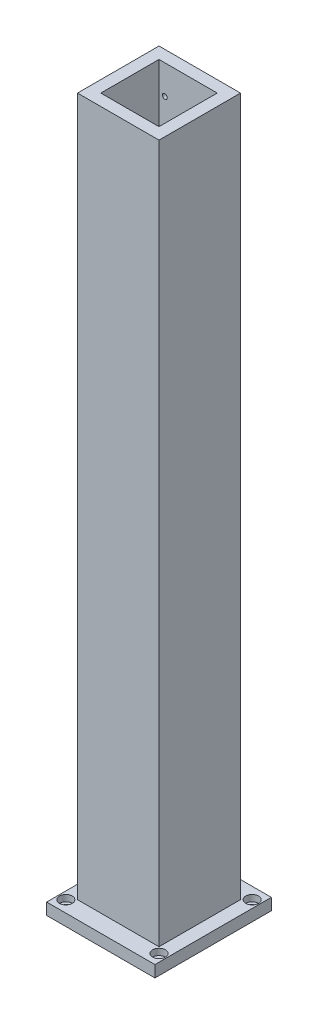
ISO-10303-21;
HEADER;
FILE_DESCRIPTION(('STEP AP214'),'2;1');
FILE_NAME('part.step','',(''),(''),'','','');
FILE_SCHEMA(('AUTOMOTIVE_DESIGN { 1 0 10303 214 1 1 1 1 }'));
ENDSEC;
DATA;
#1=APPLICATION_CONTEXT('core data for automotive mechanical design processes');
#2=APPLICATION_PROTOCOL_DEFINITION('international standard','automotive_design',2000,#1);
#3=PRODUCT_CONTEXT('',#1,'mechanical');
#4=PRODUCT('Part','Part','',(#3));
#5=PRODUCT_RELATED_PRODUCT_CATEGORY('part','',(#4));
#6=PRODUCT_DEFINITION_FORMATION('','',#4);
#7=PRODUCT_DEFINITION_CONTEXT('part definition',#1,'design');
#8=PRODUCT_DEFINITION('design','',#6,#7);
#9=PRODUCT_DEFINITION_SHAPE('','',#8);
#10=(LENGTH_UNIT() NAMED_UNIT(*) SI_UNIT(.MILLI.,.METRE.));
#11=(NAMED_UNIT(*) PLANE_ANGLE_UNIT() SI_UNIT($,.RADIAN.));
#12=(NAMED_UNIT(*) SI_UNIT($,.STERADIAN.) SOLID_ANGLE_UNIT());
#13=UNCERTAINTY_MEASURE_WITH_UNIT(LENGTH_MEASURE(1.E-05),#10,'distance_accuracy_value','');
#14=(GEOMETRIC_REPRESENTATION_CONTEXT(3) GLOBAL_UNCERTAINTY_ASSIGNED_CONTEXT((#13)) GLOBAL_UNIT_ASSIGNED_CONTEXT((#10,
#11,#12)) REPRESENTATION_CONTEXT('',''));
#15=CARTESIAN_POINT('',(0.,0.,0.));
#16=DIRECTION('',(0.,0.,1.));
#17=DIRECTION('',(1.,0.,0.));
#18=AXIS2_PLACEMENT_3D('',#15,#16,#17);
#19=CARTESIAN_POINT('',(-40.,0.,-40.));
#20=DIRECTION('',(0.,1.,0.));
#21=DIRECTION('',(0.,0.,1.));
#22=AXIS2_PLACEMENT_3D('',#19,#20,#21);
#23=CYLINDRICAL_SURFACE('',#22,2.75);
#24=CARTESIAN_POINT('',(-40.,0.,-40.));
#25=DIRECTION('',(0.,1.,0.));
#26=DIRECTION('',(0.,0.,1.));
#27=AXIS2_PLACEMENT_3D('',#24,#25,#26);
#28=CIRCLE('',#27,2.75);
#29=CARTESIAN_POINT('',(-40.,0.,-37.25));
#30=VERTEX_POINT('',#29);
#31=EDGE_CURVE('E310',#30,#30,#28,.T.);
#32=ORIENTED_EDGE('',*,*,#31,.F.);
#33=EDGE_LOOP('',(#32));
#34=FACE_BOUND('',#33,.T.);
#35=CARTESIAN_POINT('',(-40.,4.5,-40.));
#36=DIRECTION('',(0.,1.,0.));
#37=DIRECTION('',(0.,0.,1.));
#38=AXIS2_PLACEMENT_3D('',#35,#36,#37);
#39=CIRCLE('',#38,2.75);
#40=CARTESIAN_POINT('',(-40.,4.5,-37.25));
#41=VERTEX_POINT('',#40);
#42=EDGE_CURVE('E46',#41,#41,#39,.F.);
#43=ORIENTED_EDGE('',*,*,#42,.F.);
#44=EDGE_LOOP('',(#43));
#45=FACE_BOUND('',#44,.T.);
#46=ADVANCED_FACE('F42',(#34,#45),#23,.F.);
#47=CARTESIAN_POINT('',(-40.,0.,40.));
#48=DIRECTION('',(0.,1.,0.));
#49=DIRECTION('',(0.,0.,1.));
#50=AXIS2_PLACEMENT_3D('',#47,#48,#49);
#51=CYLINDRICAL_SURFACE('',#50,2.75);
#52=CARTESIAN_POINT('',(-40.,0.,40.));
#53=DIRECTION('',(0.,1.,0.));
#54=DIRECTION('',(0.,0.,1.));
#55=AXIS2_PLACEMENT_3D('',#52,#53,#54);
#56=CIRCLE('',#55,2.75);
#57=CARTESIAN_POINT('',(-40.,0.,42.75));
#58=VERTEX_POINT('',#57);
#59=EDGE_CURVE('E306',#58,#58,#56,.T.);
#60=ORIENTED_EDGE('',*,*,#59,.F.);
#61=EDGE_LOOP('',(#60));
#62=FACE_BOUND('',#61,.T.);
#63=CARTESIAN_POINT('',(-40.,4.5,40.));
#64=DIRECTION('',(0.,1.,0.));
#65=DIRECTION('',(0.,0.,1.));
#66=AXIS2_PLACEMENT_3D('',#63,#64,#65);
#67=CIRCLE('',#66,2.75);
#68=CARTESIAN_POINT('',(-40.,4.5,42.75));
#69=VERTEX_POINT('',#68);
#70=EDGE_CURVE('E285',#69,#69,#67,.F.);
#71=ORIENTED_EDGE('',*,*,#70,.F.);
#72=EDGE_LOOP('',(#71));
#73=FACE_BOUND('',#72,.T.);
#74=ADVANCED_FACE('F354',(#62,#73),#51,.F.);
#75=CARTESIAN_POINT('',(40.,0.,40.));
#76=DIRECTION('',(0.,1.,0.));
#77=DIRECTION('',(0.,0.,1.));
#78=AXIS2_PLACEMENT_3D('',#75,#76,#77);
#79=CYLINDRICAL_SURFACE('',#78,2.75);
#80=CARTESIAN_POINT('',(40.,0.,40.));
#81=DIRECTION('',(0.,1.,0.));
#82=DIRECTION('',(0.,0.,1.));
#83=AXIS2_PLACEMENT_3D('',#80,#81,#82);
#84=CIRCLE('',#83,2.75);
#85=CARTESIAN_POINT('',(40.,0.,42.75));
#86=VERTEX_POINT('',#85);
#87=EDGE_CURVE('E299',#86,#86,#84,.T.);
#88=ORIENTED_EDGE('',*,*,#87,.F.);
#89=EDGE_LOOP('',(#88));
#90=FACE_BOUND('',#89,.T.);
#91=CARTESIAN_POINT('',(40.,4.5,40.));
#92=DIRECTION('',(0.,1.,0.));
#93=DIRECTION('',(0.,0.,1.));
#94=AXIS2_PLACEMENT_3D('',#91,#92,#93);
#95=CIRCLE('',#94,2.75);
#96=CARTESIAN_POINT('',(40.,4.5,42.75));
#97=VERTEX_POINT('',#96);
#98=EDGE_CURVE('E281',#97,#97,#95,.F.);
#99=ORIENTED_EDGE('',*,*,#98,.F.);
#100=EDGE_LOOP('',(#99));
#101=FACE_BOUND('',#100,.T.);
#102=ADVANCED_FACE('F360',(#90,#101),#79,.F.);
#103=CARTESIAN_POINT('',(40.,0.,-40.));
#104=DIRECTION('',(0.,1.,0.));
#105=DIRECTION('',(0.,0.,1.));
#106=AXIS2_PLACEMENT_3D('',#103,#104,#105);
#107=CYLINDRICAL_SURFACE('',#106,2.75);
#108=CARTESIAN_POINT('',(40.,0.,-40.));
#109=DIRECTION('',(0.,1.,0.));
#110=DIRECTION('',(0.,0.,1.));
#111=AXIS2_PLACEMENT_3D('',#108,#109,#110);
#112=CIRCLE('',#111,2.75);
#113=CARTESIAN_POINT('',(40.,0.,-37.25));
#114=VERTEX_POINT('',#113);
#115=EDGE_CURVE('E293',#114,#114,#112,.T.);
#116=ORIENTED_EDGE('',*,*,#115,.F.);
#117=EDGE_LOOP('',(#116));
#118=FACE_BOUND('',#117,.T.);
#119=CARTESIAN_POINT('',(40.,4.5,-40.));
#120=DIRECTION('',(0.,1.,0.));
#121=DIRECTION('',(0.,0.,1.));
#122=AXIS2_PLACEMENT_3D('',#119,#120,#121);
#123=CIRCLE('',#122,2.75);
#124=CARTESIAN_POINT('',(40.,4.5,-37.25));
#125=VERTEX_POINT('',#124);
#126=EDGE_CURVE('E277',#125,#125,#123,.F.);
#127=ORIENTED_EDGE('',*,*,#126,.F.);
#128=EDGE_LOOP('',(#127));
#129=FACE_BOUND('',#128,.T.);
#130=ADVANCED_FACE('F367',(#118,#129),#107,.F.);
#131=CARTESIAN_POINT('',(0.,10.,0.));
#132=DIRECTION('',(0.,-1.,0.));
#133=DIRECTION('',(0.,0.,-1.));
#134=AXIS2_PLACEMENT_3D('',#131,#132,#133);
#135=PLANE('',#134);
#136=CARTESIAN_POINT('',(-40.,10.,40.));
#137=DIRECTION('',(0.,1.,0.));
#138=DIRECTION('',(0.,0.,1.));
#139=AXIS2_PLACEMENT_3D('',#136,#137,#138);
#140=CIRCLE('',#139,5.5);
#141=CARTESIAN_POINT('',(-40.,10.,45.5));
#142=VERTEX_POINT('',#141);
#143=EDGE_CURVE('E411',#142,#142,#140,.T.);
#144=ORIENTED_EDGE('',*,*,#143,.F.);
#145=EDGE_LOOP('',(#144));
#146=FACE_BOUND('',#145,.T.);
#147=CARTESIAN_POINT('',(40.,10.,40.));
#148=DIRECTION('',(0.,1.,0.));
#149=DIRECTION('',(0.,0.,1.));
#150=AXIS2_PLACEMENT_3D('',#147,#148,#149);
#151=CIRCLE('',#150,5.5);
#152=CARTESIAN_POINT('',(40.,10.,45.5));
#153=VERTEX_POINT('',#152);
#154=EDGE_CURVE('E415',#153,#153,#151,.T.);
#155=ORIENTED_EDGE('',*,*,#154,.F.);
#156=EDGE_LOOP('',(#155));
#157=FACE_BOUND('',#156,.T.);
#158=CARTESIAN_POINT('',(40.,10.,-40.));
#159=DIRECTION('',(0.,1.,0.));
#160=DIRECTION('',(0.,0.,1.));
#161=AXIS2_PLACEMENT_3D('',#158,#159,#160);
#162=CIRCLE('',#161,5.5);
#163=CARTESIAN_POINT('',(40.,10.,-34.5));
#164=VERTEX_POINT('',#163);
#165=EDGE_CURVE('E419',#164,#164,#162,.T.);
#166=ORIENTED_EDGE('',*,*,#165,.F.);
#167=EDGE_LOOP('',(#166));
#168=FACE_BOUND('',#167,.T.);
#169=CARTESIAN_POINT('',(-40.,10.,-40.));
#170=DIRECTION('',(0.,1.,0.));
#171=DIRECTION('',(0.,0.,1.));
#172=AXIS2_PLACEMENT_3D('',#169,#170,#171);
#173=CIRCLE('',#172,5.5);
#174=CARTESIAN_POINT('',(-40.,10.,-34.5));
#175=VERTEX_POINT('',#174);
#176=EDGE_CURVE('E423',#175,#175,#173,.T.);
#177=ORIENTED_EDGE('',*,*,#176,.F.);
#178=EDGE_LOOP('',(#177));
#179=FACE_BOUND('',#178,.T.);
#180=DIRECTION('',(0.,0.,-1.));
#181=VECTOR('',#180,1.);
#182=CARTESIAN_POINT('',(46.5,10.,50.));
#183=LINE('',#182,#181);
#184=CARTESIAN_POINT('',(46.5,10.,50.));
#185=VERTEX_POINT('',#184);
#186=CARTESIAN_POINT('',(46.5,10.,-50.));
#187=VERTEX_POINT('',#186);
#188=EDGE_CURVE('E230',#185,#187,#183,.T.);
#189=ORIENTED_EDGE('',*,*,#188,.T.);
#190=DIRECTION('',(-1.,0.,0.));
#191=VECTOR('',#190,1.);
#192=CARTESIAN_POINT('',(-46.5,10.,-50.));
#193=LINE('',#192,#191);
#194=CARTESIAN_POINT('',(-46.5,10.,-50.));
#195=VERTEX_POINT('',#194);
#196=EDGE_CURVE('E234',#187,#195,#193,.T.);
#197=ORIENTED_EDGE('',*,*,#196,.T.);
#198=DIRECTION('',(0.,0.,1.));
#199=VECTOR('',#198,1.);
#200=CARTESIAN_POINT('',(-46.5,10.,50.));
#201=LINE('',#200,#199);
#202=CARTESIAN_POINT('',(-46.5,10.,50.));
#203=VERTEX_POINT('',#202);
#204=EDGE_CURVE('E238',#195,#203,#201,.T.);
#205=ORIENTED_EDGE('',*,*,#204,.T.);
#206=DIRECTION('',(1.,0.,0.));
#207=VECTOR('',#206,1.);
#208=CARTESIAN_POINT('',(-46.5,10.,50.));
#209=LINE('',#208,#207);
#210=EDGE_CURVE('E241',#203,#185,#209,.T.);
#211=ORIENTED_EDGE('',*,*,#210,.T.);
#212=EDGE_LOOP('',(#189,#197,#205,#211));
#213=FACE_BOUND('',#212,.T.);
#214=DIRECTION('',(0.,0.,1.));
#215=VECTOR('',#214,1.);
#216=CARTESIAN_POINT('',(-35.,10.,35.));
#217=LINE('',#216,#215);
#218=CARTESIAN_POINT('',(-35.,10.,-35.));
#219=VERTEX_POINT('',#218);
#220=CARTESIAN_POINT('',(-35.,10.,35.));
#221=VERTEX_POINT('',#220);
#222=EDGE_CURVE('E153',#219,#221,#217,.T.);
#223=ORIENTED_EDGE('',*,*,#222,.F.);
#224=DIRECTION('',(-1.,0.,0.));
#225=VECTOR('',#224,1.);
#226=CARTESIAN_POINT('',(-35.,10.,-35.));
#227=LINE('',#226,#225);
#228=CARTESIAN_POINT('',(35.,10.,-35.));
#229=VERTEX_POINT('',#228);
#230=EDGE_CURVE('E195',#229,#219,#227,.T.);
#231=ORIENTED_EDGE('',*,*,#230,.F.);
#232=DIRECTION('',(0.,0.,-1.));
#233=VECTOR('',#232,1.);
#234=CARTESIAN_POINT('',(35.,10.,35.));
#235=LINE('',#234,#233);
#236=CARTESIAN_POINT('',(35.,10.,35.));
#237=VERTEX_POINT('',#236);
#238=EDGE_CURVE('E65',#237,#229,#235,.T.);
#239=ORIENTED_EDGE('',*,*,#238,.F.);
#240=DIRECTION('',(1.,0.,0.));
#241=VECTOR('',#240,1.);
#242=CARTESIAN_POINT('',(-35.,10.,35.));
#243=LINE('',#242,#241);
#244=EDGE_CURVE('E60',#221,#237,#243,.T.);
#245=ORIENTED_EDGE('',*,*,#244,.F.);
#246=EDGE_LOOP('',(#223,#231,#239,#245));
#247=FACE_BOUND('',#246,.T.);
#248=ADVANCED_FACE('F392',(#146,#157,#168,#179,#213,#247),#135,.F.);
#249=CARTESIAN_POINT('',(46.5,10.,50.));
#250=DIRECTION('',(-1.,0.,0.));
#251=DIRECTION('',(0.,0.,1.));
#252=AXIS2_PLACEMENT_3D('',#249,#250,#251);
#253=PLANE('',#252);
#254=DIRECTION('',(0.,0.,-1.));
#255=VECTOR('',#254,1.);
#256=CARTESIAN_POINT('',(46.5,0.,50.));
#257=LINE('',#256,#255);
#258=CARTESIAN_POINT('',(46.5,0.,50.));
#259=VERTEX_POINT('',#258);
#260=CARTESIAN_POINT('',(46.5,0.,-50.));
#261=VERTEX_POINT('',#260);
#262=EDGE_CURVE('E229',#259,#261,#257,.T.);
#263=ORIENTED_EDGE('',*,*,#262,.T.);
#264=DIRECTION('',(0.,-1.,0.));
#265=VECTOR('',#264,1.);
#266=CARTESIAN_POINT('',(46.5,10.,-50.));
#267=LINE('',#266,#265);
#268=EDGE_CURVE('E11',#187,#261,#267,.T.);
#269=ORIENTED_EDGE('',*,*,#268,.F.);
#270=ORIENTED_EDGE('',*,*,#188,.F.);
#271=DIRECTION('',(0.,-1.,0.));
#272=VECTOR('',#271,1.);
#273=CARTESIAN_POINT('',(46.5,10.,50.));
#274=LINE('',#273,#272);
#275=EDGE_CURVE('E244',#185,#259,#274,.T.);
#276=ORIENTED_EDGE('',*,*,#275,.T.);
#277=EDGE_LOOP('',(#263,#269,#270,#276));
#278=FACE_BOUND('',#277,.T.);
#279=ADVANCED_FACE('F44',(#278),#253,.F.);
#280=CARTESIAN_POINT('',(-46.5,10.,-50.));
#281=DIRECTION('',(0.,0.,1.));
#282=DIRECTION('',(1.,0.,0.));
#283=AXIS2_PLACEMENT_3D('',#280,#281,#282);
#284=PLANE('',#283);
#285=DIRECTION('',(-1.,0.,0.));
#286=VECTOR('',#285,1.);
#287=CARTESIAN_POINT('',(-46.5,0.,-50.));
#288=LINE('',#287,#286);
#289=CARTESIAN_POINT('',(-46.5,0.,-50.));
#290=VERTEX_POINT('',#289);
#291=EDGE_CURVE('E248',#261,#290,#288,.T.);
#292=ORIENTED_EDGE('',*,*,#291,.T.);
#293=DIRECTION('',(0.,-1.,0.));
#294=VECTOR('',#293,1.);
#295=CARTESIAN_POINT('',(-46.5,10.,-50.));
#296=LINE('',#295,#294);
#297=EDGE_CURVE('E52',#195,#290,#296,.T.);
#298=ORIENTED_EDGE('',*,*,#297,.F.);
#299=ORIENTED_EDGE('',*,*,#196,.F.);
#300=ORIENTED_EDGE('',*,*,#268,.T.);
#301=EDGE_LOOP('',(#292,#298,#299,#300));
#302=FACE_BOUND('',#301,.T.);
#303=ADVANCED_FACE('F405',(#302),#284,.F.);
#304=CARTESIAN_POINT('',(-46.5,10.,50.));
#305=DIRECTION('',(1.,0.,0.));
#306=DIRECTION('',(0.,0.,-1.));
#307=AXIS2_PLACEMENT_3D('',#304,#305,#306);
#308=PLANE('',#307);
#309=DIRECTION('',(0.,0.,1.));
#310=VECTOR('',#309,1.);
#311=CARTESIAN_POINT('',(-46.5,0.,50.));
#312=LINE('',#311,#310);
#313=CARTESIAN_POINT('',(-46.5,0.,50.));
#314=VERTEX_POINT('',#313);
#315=EDGE_CURVE('E251',#290,#314,#312,.T.);
#316=ORIENTED_EDGE('',*,*,#315,.T.);
#317=DIRECTION('',(0.,-1.,0.));
#318=VECTOR('',#317,1.);
#319=CARTESIAN_POINT('',(-46.5,10.,50.));
#320=LINE('',#319,#318);
#321=EDGE_CURVE('E259',#203,#314,#320,.T.);
#322=ORIENTED_EDGE('',*,*,#321,.F.);
#323=ORIENTED_EDGE('',*,*,#204,.F.);
#324=ORIENTED_EDGE('',*,*,#297,.T.);
#325=EDGE_LOOP('',(#316,#322,#323,#324));
#326=FACE_BOUND('',#325,.T.);
#327=ADVANCED_FACE('F461',(#326),#308,.F.);
#328=CARTESIAN_POINT('',(-46.5,10.,50.));
#329=DIRECTION('',(0.,0.,-1.));
#330=DIRECTION('',(-1.,0.,0.));
#331=AXIS2_PLACEMENT_3D('',#328,#329,#330);
#332=PLANE('',#331);
#333=DIRECTION('',(1.,0.,0.));
#334=VECTOR('',#333,1.);
#335=CARTESIAN_POINT('',(-46.5,0.,50.));
#336=LINE('',#335,#334);
#337=EDGE_CURVE('E235',#314,#259,#336,.T.);
#338=ORIENTED_EDGE('',*,*,#337,.T.);
#339=ORIENTED_EDGE('',*,*,#275,.F.);
#340=ORIENTED_EDGE('',*,*,#210,.F.);
#341=ORIENTED_EDGE('',*,*,#321,.T.);
#342=EDGE_LOOP('',(#338,#339,#340,#341));
#343=FACE_BOUND('',#342,.T.);
#344=ADVANCED_FACE('F457',(#343),#332,.F.);
#345=CARTESIAN_POINT('',(0.,0.,0.));
#346=DIRECTION('',(0.,-1.,0.));
#347=DIRECTION('',(0.,0.,-1.));
#348=AXIS2_PLACEMENT_3D('',#345,#346,#347);
#349=PLANE('',#348);
#350=ORIENTED_EDGE('',*,*,#115,.T.);
#351=EDGE_LOOP('',(#350));
#352=FACE_BOUND('',#351,.T.);
#353=ORIENTED_EDGE('',*,*,#87,.T.);
#354=EDGE_LOOP('',(#353));
#355=FACE_BOUND('',#354,.T.);
#356=ORIENTED_EDGE('',*,*,#59,.T.);
#357=EDGE_LOOP('',(#356));
#358=FACE_BOUND('',#357,.T.);
#359=ORIENTED_EDGE('',*,*,#31,.T.);
#360=EDGE_LOOP('',(#359));
#361=FACE_BOUND('',#360,.T.);
#362=ORIENTED_EDGE('',*,*,#262,.F.);
#363=ORIENTED_EDGE('',*,*,#337,.F.);
#364=ORIENTED_EDGE('',*,*,#315,.F.);
#365=ORIENTED_EDGE('',*,*,#291,.F.);
#366=EDGE_LOOP('',(#362,#363,#364,#365));
#367=FACE_BOUND('',#366,.T.);
#368=ADVANCED_FACE('F453',(#352,#355,#358,#361,#367),#349,.T.);
#369=CARTESIAN_POINT('',(0.,610.,0.));
#370=DIRECTION('',(0.,-1.,0.));
#371=DIRECTION('',(0.,0.,-1.));
#372=AXIS2_PLACEMENT_3D('',#369,#370,#371);
#373=PLANE('',#372);
#374=DIRECTION('',(0.,0.,1.));
#375=VECTOR('',#374,1.);
#376=CARTESIAN_POINT('',(-35.,610.,35.));
#377=LINE('',#376,#375);
#378=CARTESIAN_POINT('',(-35.,610.,-35.));
#379=VERTEX_POINT('',#378);
#380=CARTESIAN_POINT('',(-35.,610.,35.));
#381=VERTEX_POINT('',#380);
#382=EDGE_CURVE('E190',#379,#381,#377,.T.);
#383=ORIENTED_EDGE('',*,*,#382,.T.);
#384=DIRECTION('',(1.,0.,0.));
#385=VECTOR('',#384,1.);
#386=CARTESIAN_POINT('',(-35.,610.,35.));
#387=LINE('',#386,#385);
#388=CARTESIAN_POINT('',(35.,610.,35.));
#389=VERTEX_POINT('',#388);
#390=EDGE_CURVE('E194',#381,#389,#387,.T.);
#391=ORIENTED_EDGE('',*,*,#390,.T.);
#392=DIRECTION('',(0.,0.,-1.));
#393=VECTOR('',#392,1.);
#394=CARTESIAN_POINT('',(35.,610.,35.));
#395=LINE('',#394,#393);
#396=CARTESIAN_POINT('',(35.,610.,-35.));
#397=VERTEX_POINT('',#396);
#398=EDGE_CURVE('E198',#389,#397,#395,.T.);
#399=ORIENTED_EDGE('',*,*,#398,.T.);
#400=DIRECTION('',(-1.,0.,0.));
#401=VECTOR('',#400,1.);
#402=CARTESIAN_POINT('',(-35.,610.,-35.));
#403=LINE('',#402,#401);
#404=EDGE_CURVE('E201',#397,#379,#403,.T.);
#405=ORIENTED_EDGE('',*,*,#404,.T.);
#406=EDGE_LOOP('',(#383,#391,#399,#405));
#407=FACE_BOUND('',#406,.T.);
#408=DIRECTION('',(0.,0.,-1.));
#409=VECTOR('',#408,1.);
#410=CARTESIAN_POINT('',(25.,610.,25.));
#411=LINE('',#410,#409);
#412=CARTESIAN_POINT('',(25.,610.,25.));
#413=VERTEX_POINT('',#412);
#414=CARTESIAN_POINT('',(25.,610.,-25.));
#415=VERTEX_POINT('',#414);
#416=EDGE_CURVE('E133',#413,#415,#411,.T.);
#417=ORIENTED_EDGE('',*,*,#416,.F.);
#418=DIRECTION('',(1.,0.,0.));
#419=VECTOR('',#418,1.);
#420=CARTESIAN_POINT('',(-25.,610.,25.));
#421=LINE('',#420,#419);
#422=CARTESIAN_POINT('',(-25.,610.,25.));
#423=VERTEX_POINT('',#422);
#424=EDGE_CURVE('E164',#423,#413,#421,.T.);
#425=ORIENTED_EDGE('',*,*,#424,.F.);
#426=DIRECTION('',(0.,0.,1.));
#427=VECTOR('',#426,1.);
#428=CARTESIAN_POINT('',(-25.,610.,25.));
#429=LINE('',#428,#427);
#430=CARTESIAN_POINT('',(-25.,610.,-25.));
#431=VERTEX_POINT('',#430);
#432=EDGE_CURVE('E159',#431,#423,#429,.T.);
#433=ORIENTED_EDGE('',*,*,#432,.F.);
#434=DIRECTION('',(-1.,0.,0.));
#435=VECTOR('',#434,1.);
#436=CARTESIAN_POINT('',(-25.,610.,-25.));
#437=LINE('',#436,#435);
#438=EDGE_CURVE('E144',#415,#431,#437,.T.);
#439=ORIENTED_EDGE('',*,*,#438,.F.);
#440=EDGE_LOOP('',(#417,#425,#433,#439));
#441=FACE_BOUND('',#440,.T.);
#442=ADVANCED_FACE('F157',(#407,#441),#373,.F.);
#443=CARTESIAN_POINT('',(-35.,610.,35.));
#444=DIRECTION('',(1.,0.,0.));
#445=DIRECTION('',(0.,0.,-1.));
#446=AXIS2_PLACEMENT_3D('',#443,#444,#445);
#447=PLANE('',#446);
#448=ORIENTED_EDGE('',*,*,#222,.T.);
#449=DIRECTION('',(0.,-1.,0.));
#450=VECTOR('',#449,1.);
#451=CARTESIAN_POINT('',(-35.,610.,35.));
#452=LINE('',#451,#450);
#453=EDGE_CURVE('E226',#381,#221,#452,.T.);
#454=ORIENTED_EDGE('',*,*,#453,.F.);
#455=ORIENTED_EDGE('',*,*,#382,.F.);
#456=DIRECTION('',(0.,-1.,0.));
#457=VECTOR('',#456,1.);
#458=CARTESIAN_POINT('',(-35.,610.,-35.));
#459=LINE('',#458,#457);
#460=EDGE_CURVE('E204',#379,#219,#459,.T.);
#461=ORIENTED_EDGE('',*,*,#460,.T.);
#462=EDGE_LOOP('',(#448,#454,#455,#461));
#463=FACE_BOUND('',#462,.T.);
#464=ADVANCED_FACE('F433',(#463),#447,.F.);
#465=CARTESIAN_POINT('',(-35.,610.,35.));
#466=DIRECTION('',(0.,0.,-1.));
#467=DIRECTION('',(-1.,0.,0.));
#468=AXIS2_PLACEMENT_3D('',#465,#466,#467);
#469=PLANE('',#468);
#470=ORIENTED_EDGE('',*,*,#244,.T.);
#471=DIRECTION('',(0.,-1.,0.));
#472=VECTOR('',#471,1.);
#473=CARTESIAN_POINT('',(35.,610.,35.));
#474=LINE('',#473,#472);
#475=EDGE_CURVE('E222',#389,#237,#474,.T.);
#476=ORIENTED_EDGE('',*,*,#475,.F.);
#477=ORIENTED_EDGE('',*,*,#390,.F.);
#478=ORIENTED_EDGE('',*,*,#453,.T.);
#479=EDGE_LOOP('',(#470,#476,#477,#478));
#480=FACE_BOUND('',#479,.T.);
#481=ADVANCED_FACE('F440',(#480),#469,.F.);
#482=CARTESIAN_POINT('',(35.,610.,35.));
#483=DIRECTION('',(-1.,0.,0.));
#484=DIRECTION('',(0.,0.,1.));
#485=AXIS2_PLACEMENT_3D('',#482,#483,#484);
#486=PLANE('',#485);
#487=ORIENTED_EDGE('',*,*,#238,.T.);
#488=DIRECTION('',(0.,-1.,0.));
#489=VECTOR('',#488,1.);
#490=CARTESIAN_POINT('',(35.,610.,-35.));
#491=LINE('',#490,#489);
#492=EDGE_CURVE('E218',#397,#229,#491,.T.);
#493=ORIENTED_EDGE('',*,*,#492,.F.);
#494=ORIENTED_EDGE('',*,*,#398,.F.);
#495=ORIENTED_EDGE('',*,*,#475,.T.);
#496=EDGE_LOOP('',(#487,#493,#494,#495));
#497=FACE_BOUND('',#496,.T.);
#498=ADVANCED_FACE('F438',(#497),#486,.F.);
#499=CARTESIAN_POINT('',(-35.,610.,-35.));
#500=DIRECTION('',(0.,0.,1.));
#501=DIRECTION('',(1.,0.,0.));
#502=AXIS2_PLACEMENT_3D('',#499,#500,#501);
#503=PLANE('',#502);
#504=CARTESIAN_POINT('',(20.,585.,-35.));
#505=DIRECTION('',(0.,0.,-1.));
#506=DIRECTION('',(-1.,0.,0.));
#507=AXIS2_PLACEMENT_3D('',#504,#505,#506);
#508=CIRCLE('',#507,2.09999999999999);
#509=CARTESIAN_POINT('',(17.9,585.,-35.));
#510=VERTEX_POINT('',#509);
#511=EDGE_CURVE('E314',#510,#510,#508,.T.);
#512=ORIENTED_EDGE('',*,*,#511,.F.);
#513=EDGE_LOOP('',(#512));
#514=FACE_BOUND('',#513,.T.);
#515=CARTESIAN_POINT('',(-20.,585.,-35.));
#516=DIRECTION('',(0.,0.,-1.));
#517=DIRECTION('',(-1.,0.,0.));
#518=AXIS2_PLACEMENT_3D('',#515,#516,#517);
#519=CIRCLE('',#518,2.09999999999999);
#520=CARTESIAN_POINT('',(-22.1,585.,-35.));
#521=VERTEX_POINT('',#520);
#522=EDGE_CURVE('E276',#521,#521,#519,.T.);
#523=ORIENTED_EDGE('',*,*,#522,.F.);
#524=EDGE_LOOP('',(#523));
#525=FACE_BOUND('',#524,.T.);
#526=CARTESIAN_POINT('',(-20.,555.,-35.));
#527=DIRECTION('',(0.,0.,-1.));
#528=DIRECTION('',(-1.,0.,0.));
#529=AXIS2_PLACEMENT_3D('',#526,#527,#528);
#530=CIRCLE('',#529,2.09999999999999);
#531=CARTESIAN_POINT('',(-22.1,555.,-35.));
#532=VERTEX_POINT('',#531);
#533=EDGE_CURVE('E271',#532,#532,#530,.T.);
#534=ORIENTED_EDGE('',*,*,#533,.F.);
#535=EDGE_LOOP('',(#534));
#536=FACE_BOUND('',#535,.T.);
#537=CARTESIAN_POINT('',(20.,555.,-35.));
#538=DIRECTION('',(0.,0.,-1.));
#539=DIRECTION('',(-1.,0.,0.));
#540=AXIS2_PLACEMENT_3D('',#537,#538,#539);
#541=CIRCLE('',#540,2.09999999999999);
#542=CARTESIAN_POINT('',(17.9,555.,-35.));
#543=VERTEX_POINT('',#542);
#544=EDGE_CURVE('E270',#543,#543,#541,.T.);
#545=ORIENTED_EDGE('',*,*,#544,.F.);
#546=EDGE_LOOP('',(#545));
#547=FACE_BOUND('',#546,.T.);
#548=ORIENTED_EDGE('',*,*,#230,.T.);
#549=ORIENTED_EDGE('',*,*,#460,.F.);
#550=ORIENTED_EDGE('',*,*,#404,.F.);
#551=ORIENTED_EDGE('',*,*,#492,.T.);
#552=EDGE_LOOP('',(#548,#549,#550,#551));
#553=FACE_BOUND('',#552,.T.);
#554=ADVANCED_FACE('F349',(#514,#525,#536,#547,#553),#503,.F.);
#555=CARTESIAN_POINT('',(25.,610.,25.));
#556=DIRECTION('',(-1.,0.,0.));
#557=DIRECTION('',(0.,0.,1.));
#558=AXIS2_PLACEMENT_3D('',#555,#556,#557);
#559=PLANE('',#558);
#560=DIRECTION('',(0.,0.,-1.));
#561=VECTOR('',#560,1.);
#562=CARTESIAN_POINT('',(25.,10.,25.));
#563=LINE('',#562,#561);
#564=CARTESIAN_POINT('',(25.,10.,25.));
#565=VERTEX_POINT('',#564);
#566=CARTESIAN_POINT('',(25.,10.,-25.));
#567=VERTEX_POINT('',#566);
#568=EDGE_CURVE('E170',#565,#567,#563,.T.);
#569=ORIENTED_EDGE('',*,*,#568,.F.);
#570=DIRECTION('',(0.,-1.,0.));
#571=VECTOR('',#570,1.);
#572=CARTESIAN_POINT('',(25.,610.,25.));
#573=LINE('',#572,#571);
#574=EDGE_CURVE('E139',#413,#565,#573,.T.);
#575=ORIENTED_EDGE('',*,*,#574,.F.);
#576=ORIENTED_EDGE('',*,*,#416,.T.);
#577=DIRECTION('',(0.,-1.,0.));
#578=VECTOR('',#577,1.);
#579=CARTESIAN_POINT('',(25.,610.,-25.));
#580=LINE('',#579,#578);
#581=EDGE_CURVE('E137',#415,#567,#580,.T.);
#582=ORIENTED_EDGE('',*,*,#581,.T.);
#583=EDGE_LOOP('',(#569,#575,#576,#582));
#584=FACE_BOUND('',#583,.T.);
#585=ADVANCED_FACE('F136',(#584),#559,.T.);
#586=CARTESIAN_POINT('',(-25.,610.,-25.));
#587=DIRECTION('',(0.,0.,1.));
#588=DIRECTION('',(1.,0.,0.));
#589=AXIS2_PLACEMENT_3D('',#586,#587,#588);
#590=PLANE('',#589);
#591=CARTESIAN_POINT('',(20.,585.,-25.));
#592=DIRECTION('',(0.,0.,1.));
#593=DIRECTION('',(1.,0.,0.));
#594=AXIS2_PLACEMENT_3D('',#591,#592,#593);
#595=CIRCLE('',#594,2.09999999999999);
#596=CARTESIAN_POINT('',(22.1,585.,-25.));
#597=VERTEX_POINT('',#596);
#598=EDGE_CURVE('E318',#597,#597,#595,.T.);
#599=ORIENTED_EDGE('',*,*,#598,.F.);
#600=EDGE_LOOP('',(#599));
#601=FACE_BOUND('',#600,.T.);
#602=CARTESIAN_POINT('',(-20.,585.,-25.));
#603=DIRECTION('',(0.,0.,1.));
#604=DIRECTION('',(1.,0.,0.));
#605=AXIS2_PLACEMENT_3D('',#602,#603,#604);
#606=CIRCLE('',#605,2.09999999999999);
#607=CARTESIAN_POINT('',(-17.9,585.,-25.));
#608=VERTEX_POINT('',#607);
#609=EDGE_CURVE('E272',#608,#608,#606,.T.);
#610=ORIENTED_EDGE('',*,*,#609,.F.);
#611=EDGE_LOOP('',(#610));
#612=FACE_BOUND('',#611,.T.);
#613=CARTESIAN_POINT('',(-20.,555.,-25.));
#614=DIRECTION('',(0.,0.,1.));
#615=DIRECTION('',(1.,0.,0.));
#616=AXIS2_PLACEMENT_3D('',#613,#614,#615);
#617=CIRCLE('',#616,2.09999999999999);
#618=CARTESIAN_POINT('',(-17.9,555.,-25.));
#619=VERTEX_POINT('',#618);
#620=EDGE_CURVE('E266',#619,#619,#617,.T.);
#621=ORIENTED_EDGE('',*,*,#620,.F.);
#622=EDGE_LOOP('',(#621));
#623=FACE_BOUND('',#622,.T.);
#624=CARTESIAN_POINT('',(20.,555.,-25.));
#625=DIRECTION('',(0.,0.,1.));
#626=DIRECTION('',(1.,0.,0.));
#627=AXIS2_PLACEMENT_3D('',#624,#625,#626);
#628=CIRCLE('',#627,2.09999999999999);
#629=CARTESIAN_POINT('',(22.1,555.,-25.));
#630=VERTEX_POINT('',#629);
#631=EDGE_CURVE('E173',#630,#630,#628,.T.);
#632=ORIENTED_EDGE('',*,*,#631,.F.);
#633=EDGE_LOOP('',(#632));
#634=FACE_BOUND('',#633,.T.);
#635=DIRECTION('',(-1.,0.,0.));
#636=VECTOR('',#635,1.);
#637=CARTESIAN_POINT('',(-25.,10.,-25.));
#638=LINE('',#637,#636);
#639=CARTESIAN_POINT('',(-25.,10.,-25.));
#640=VERTEX_POINT('',#639);
#641=EDGE_CURVE('E151',#567,#640,#638,.T.);
#642=ORIENTED_EDGE('',*,*,#641,.F.);
#643=ORIENTED_EDGE('',*,*,#581,.F.);
#644=ORIENTED_EDGE('',*,*,#438,.T.);
#645=DIRECTION('',(0.,-1.,0.));
#646=VECTOR('',#645,1.);
#647=CARTESIAN_POINT('',(-25.,610.,-25.));
#648=LINE('',#647,#646);
#649=EDGE_CURVE('E154',#431,#640,#648,.T.);
#650=ORIENTED_EDGE('',*,*,#649,.T.);
#651=EDGE_LOOP('',(#642,#643,#644,#650));
#652=FACE_BOUND('',#651,.T.);
#653=ADVANCED_FACE('F148',(#601,#612,#623,#634,#652),#590,.T.);
#654=CARTESIAN_POINT('',(-25.,610.,25.));
#655=DIRECTION('',(1.,0.,0.));
#656=DIRECTION('',(0.,0.,-1.));
#657=AXIS2_PLACEMENT_3D('',#654,#655,#656);
#658=PLANE('',#657);
#659=DIRECTION('',(0.,0.,1.));
#660=VECTOR('',#659,1.);
#661=CARTESIAN_POINT('',(-25.,10.,25.));
#662=LINE('',#661,#660);
#663=CARTESIAN_POINT('',(-25.,10.,25.));
#664=VERTEX_POINT('',#663);
#665=EDGE_CURVE('E176',#640,#664,#662,.T.);
#666=ORIENTED_EDGE('',*,*,#665,.F.);
#667=ORIENTED_EDGE('',*,*,#649,.F.);
#668=ORIENTED_EDGE('',*,*,#432,.T.);
#669=DIRECTION('',(0.,-1.,0.));
#670=VECTOR('',#669,1.);
#671=CARTESIAN_POINT('',(-25.,610.,25.));
#672=LINE('',#671,#670);
#673=EDGE_CURVE('E185',#423,#664,#672,.T.);
#674=ORIENTED_EDGE('',*,*,#673,.T.);
#675=EDGE_LOOP('',(#666,#667,#668,#674));
#676=FACE_BOUND('',#675,.T.);
#677=ADVANCED_FACE('F339',(#676),#658,.T.);
#678=CARTESIAN_POINT('',(-25.,610.,25.));
#679=DIRECTION('',(0.,0.,-1.));
#680=DIRECTION('',(-1.,0.,0.));
#681=AXIS2_PLACEMENT_3D('',#678,#679,#680);
#682=PLANE('',#681);
#683=DIRECTION('',(1.,0.,0.));
#684=VECTOR('',#683,1.);
#685=CARTESIAN_POINT('',(-25.,10.,25.));
#686=LINE('',#685,#684);
#687=EDGE_CURVE('E145',#664,#565,#686,.T.);
#688=ORIENTED_EDGE('',*,*,#687,.F.);
#689=ORIENTED_EDGE('',*,*,#673,.F.);
#690=ORIENTED_EDGE('',*,*,#424,.T.);
#691=ORIENTED_EDGE('',*,*,#574,.T.);
#692=EDGE_LOOP('',(#688,#689,#690,#691));
#693=FACE_BOUND('',#692,.T.);
#694=ADVANCED_FACE('F346',(#693),#682,.T.);
#695=ORIENTED_EDGE('',*,*,#687,.T.);
#696=ORIENTED_EDGE('',*,*,#568,.T.);
#697=ORIENTED_EDGE('',*,*,#641,.T.);
#698=ORIENTED_EDGE('',*,*,#665,.T.);
#699=EDGE_LOOP('',(#695,#696,#697,#698));
#700=FACE_BOUND('',#699,.T.);
#701=ADVANCED_FACE('F384',(#700),#135,.F.);
#702=CARTESIAN_POINT('',(20.,555.,-35.));
#703=DIRECTION('',(0.,0.,-1.));
#704=DIRECTION('',(-1.,0.,0.));
#705=AXIS2_PLACEMENT_3D('',#702,#703,#704);
#706=CYLINDRICAL_SURFACE('',#705,2.09999999999999);
#707=ORIENTED_EDGE('',*,*,#631,.T.);
#708=EDGE_LOOP('',(#707));
#709=FACE_BOUND('',#708,.T.);
#710=ORIENTED_EDGE('',*,*,#544,.T.);
#711=EDGE_LOOP('',(#710));
#712=FACE_BOUND('',#711,.T.);
#713=ADVANCED_FACE('F335',(#709,#712),#706,.F.);
#714=CARTESIAN_POINT('',(-20.,555.,-35.));
#715=DIRECTION('',(0.,0.,-1.));
#716=DIRECTION('',(-1.,0.,0.));
#717=AXIS2_PLACEMENT_3D('',#714,#715,#716);
#718=CYLINDRICAL_SURFACE('',#717,2.09999999999999);
#719=ORIENTED_EDGE('',*,*,#620,.T.);
#720=EDGE_LOOP('',(#719));
#721=FACE_BOUND('',#720,.T.);
#722=ORIENTED_EDGE('',*,*,#533,.T.);
#723=EDGE_LOOP('',(#722));
#724=FACE_BOUND('',#723,.T.);
#725=ADVANCED_FACE('F377',(#721,#724),#718,.F.);
#726=CARTESIAN_POINT('',(-20.,585.,-35.));
#727=DIRECTION('',(0.,0.,-1.));
#728=DIRECTION('',(-1.,0.,0.));
#729=AXIS2_PLACEMENT_3D('',#726,#727,#728);
#730=CYLINDRICAL_SURFACE('',#729,2.09999999999999);
#731=ORIENTED_EDGE('',*,*,#609,.T.);
#732=EDGE_LOOP('',(#731));
#733=FACE_BOUND('',#732,.T.);
#734=ORIENTED_EDGE('',*,*,#522,.T.);
#735=EDGE_LOOP('',(#734));
#736=FACE_BOUND('',#735,.T.);
#737=ADVANCED_FACE('F373',(#733,#736),#730,.F.);
#738=CARTESIAN_POINT('',(20.,585.,-35.));
#739=DIRECTION('',(0.,0.,-1.));
#740=DIRECTION('',(-1.,0.,0.));
#741=AXIS2_PLACEMENT_3D('',#738,#739,#740);
#742=CYLINDRICAL_SURFACE('',#741,2.09999999999999);
#743=ORIENTED_EDGE('',*,*,#598,.T.);
#744=EDGE_LOOP('',(#743));
#745=FACE_BOUND('',#744,.T.);
#746=ORIENTED_EDGE('',*,*,#511,.T.);
#747=EDGE_LOOP('',(#746));
#748=FACE_BOUND('',#747,.T.);
#749=ADVANCED_FACE('F369',(#745,#748),#742,.F.);
#750=CARTESIAN_POINT('',(40.,4.5,-40.));
#751=DIRECTION('',(0.,1.,0.));
#752=DIRECTION('',(0.,0.,1.));
#753=AXIS2_PLACEMENT_3D('',#750,#751,#752);
#754=PLANE('',#753);
#755=CARTESIAN_POINT('',(40.,4.5,-40.));
#756=DIRECTION('',(0.,1.,0.));
#757=DIRECTION('',(0.,0.,1.));
#758=AXIS2_PLACEMENT_3D('',#755,#756,#757);
#759=CIRCLE('',#758,5.5);
#760=CARTESIAN_POINT('',(40.,4.5,-34.5));
#761=VERTEX_POINT('',#760);
#762=EDGE_CURVE('E675',#761,#761,#759,.T.);
#763=ORIENTED_EDGE('',*,*,#762,.T.);
#764=EDGE_LOOP('',(#763));
#765=FACE_BOUND('',#764,.T.);
#766=ORIENTED_EDGE('',*,*,#126,.T.);
#767=EDGE_LOOP('',(#766));
#768=FACE_BOUND('',#767,.T.);
#769=ADVANCED_FACE('F372',(#765,#768),#754,.T.);
#770=CARTESIAN_POINT('',(40.,4.5,-40.));
#771=DIRECTION('',(0.,1.,0.));
#772=DIRECTION('',(0.,0.,1.));
#773=AXIS2_PLACEMENT_3D('',#770,#771,#772);
#774=CYLINDRICAL_SURFACE('',#773,5.5);
#775=ORIENTED_EDGE('',*,*,#762,.F.);
#776=EDGE_LOOP('',(#775));
#777=FACE_BOUND('',#776,.T.);
#778=ORIENTED_EDGE('',*,*,#165,.T.);
#779=EDGE_LOOP('',(#778));
#780=FACE_BOUND('',#779,.T.);
#781=ADVANCED_FACE('F581',(#777,#780),#774,.F.);
#782=CARTESIAN_POINT('',(40.,4.5,40.));
#783=DIRECTION('',(0.,1.,0.));
#784=DIRECTION('',(0.,0.,1.));
#785=AXIS2_PLACEMENT_3D('',#782,#783,#784);
#786=PLANE('',#785);
#787=CARTESIAN_POINT('',(40.,4.5,40.));
#788=DIRECTION('',(0.,1.,0.));
#789=DIRECTION('',(0.,0.,1.));
#790=AXIS2_PLACEMENT_3D('',#787,#788,#789);
#791=CIRCLE('',#790,5.5);
#792=CARTESIAN_POINT('',(40.,4.5,45.5));
#793=VERTEX_POINT('',#792);
#794=EDGE_CURVE('E687',#793,#793,#791,.T.);
#795=ORIENTED_EDGE('',*,*,#794,.T.);
#796=EDGE_LOOP('',(#795));
#797=FACE_BOUND('',#796,.T.);
#798=ORIENTED_EDGE('',*,*,#98,.T.);
#799=EDGE_LOOP('',(#798));
#800=FACE_BOUND('',#799,.T.);
#801=ADVANCED_FACE('F592',(#797,#800),#786,.T.);
#802=CARTESIAN_POINT('',(40.,4.5,40.));
#803=DIRECTION('',(0.,1.,0.));
#804=DIRECTION('',(0.,0.,1.));
#805=AXIS2_PLACEMENT_3D('',#802,#803,#804);
#806=CYLINDRICAL_SURFACE('',#805,5.5);
#807=ORIENTED_EDGE('',*,*,#794,.F.);
#808=EDGE_LOOP('',(#807));
#809=FACE_BOUND('',#808,.T.);
#810=ORIENTED_EDGE('',*,*,#154,.T.);
#811=EDGE_LOOP('',(#810));
#812=FACE_BOUND('',#811,.T.);
#813=ADVANCED_FACE('F602',(#809,#812),#806,.F.);
#814=CARTESIAN_POINT('',(-40.,4.5,40.));
#815=DIRECTION('',(0.,1.,0.));
#816=DIRECTION('',(0.,0.,1.));
#817=AXIS2_PLACEMENT_3D('',#814,#815,#816);
#818=PLANE('',#817);
#819=CARTESIAN_POINT('',(-40.,4.5,40.));
#820=DIRECTION('',(0.,1.,0.));
#821=DIRECTION('',(0.,0.,1.));
#822=AXIS2_PLACEMENT_3D('',#819,#820,#821);
#823=CIRCLE('',#822,5.5);
#824=CARTESIAN_POINT('',(-40.,4.5,45.5));
#825=VERTEX_POINT('',#824);
#826=EDGE_CURVE('E681',#825,#825,#823,.T.);
#827=ORIENTED_EDGE('',*,*,#826,.T.);
#828=EDGE_LOOP('',(#827));
#829=FACE_BOUND('',#828,.T.);
#830=ORIENTED_EDGE('',*,*,#70,.T.);
#831=EDGE_LOOP('',(#830));
#832=FACE_BOUND('',#831,.T.);
#833=ADVANCED_FACE('F612',(#829,#832),#818,.T.);
#834=CARTESIAN_POINT('',(-40.,4.5,40.));
#835=DIRECTION('',(0.,1.,0.));
#836=DIRECTION('',(0.,0.,1.));
#837=AXIS2_PLACEMENT_3D('',#834,#835,#836);
#838=CYLINDRICAL_SURFACE('',#837,5.5);
#839=ORIENTED_EDGE('',*,*,#826,.F.);
#840=EDGE_LOOP('',(#839));
#841=FACE_BOUND('',#840,.T.);
#842=ORIENTED_EDGE('',*,*,#143,.T.);
#843=EDGE_LOOP('',(#842));
#844=FACE_BOUND('',#843,.T.);
#845=ADVANCED_FACE('F622',(#841,#844),#838,.F.);
#846=CARTESIAN_POINT('',(-40.,4.5,-40.));
#847=DIRECTION('',(0.,1.,0.));
#848=DIRECTION('',(0.,0.,1.));
#849=AXIS2_PLACEMENT_3D('',#846,#847,#848);
#850=PLANE('',#849);
#851=CARTESIAN_POINT('',(-40.,4.5,-40.));
#852=DIRECTION('',(0.,1.,0.));
#853=DIRECTION('',(0.,0.,1.));
#854=AXIS2_PLACEMENT_3D('',#851,#852,#853);
#855=CIRCLE('',#854,5.5);
#856=CARTESIAN_POINT('',(-40.,4.5,-34.5));
#857=VERTEX_POINT('',#856);
#858=EDGE_CURVE('E282',#857,#857,#855,.T.);
#859=ORIENTED_EDGE('',*,*,#858,.T.);
#860=EDGE_LOOP('',(#859));
#861=FACE_BOUND('',#860,.T.);
#862=ORIENTED_EDGE('',*,*,#42,.T.);
#863=EDGE_LOOP('',(#862));
#864=FACE_BOUND('',#863,.T.);
#865=ADVANCED_FACE('F632',(#861,#864),#850,.T.);
#866=CARTESIAN_POINT('',(-40.,4.5,-40.));
#867=DIRECTION('',(0.,1.,0.));
#868=DIRECTION('',(0.,0.,1.));
#869=AXIS2_PLACEMENT_3D('',#866,#867,#868);
#870=CYLINDRICAL_SURFACE('',#869,5.5);
#871=ORIENTED_EDGE('',*,*,#858,.F.);
#872=EDGE_LOOP('',(#871));
#873=FACE_BOUND('',#872,.T.);
#874=ORIENTED_EDGE('',*,*,#176,.T.);
#875=EDGE_LOOP('',(#874));
#876=FACE_BOUND('',#875,.T.);
#877=ADVANCED_FACE('F642',(#873,#876),#870,.F.);
#878=CLOSED_SHELL('',(#46,#74,#102,#130,#248,#279,#303,#327,#344,#368,#442,#464,#481,#498,#554,
#585,#653,#677,#694,#701,#713,#725,#737,#749,#769,#781,#801,#813,#833,#845,#865,#877));
#879=MANIFOLD_SOLID_BREP('B2',#878);
#880=ADVANCED_BREP_SHAPE_REPRESENTATION('',(#18,#879),#14);
#881=SHAPE_DEFINITION_REPRESENTATION(#9,#880);
ENDSEC;
END-ISO-10303-21;
